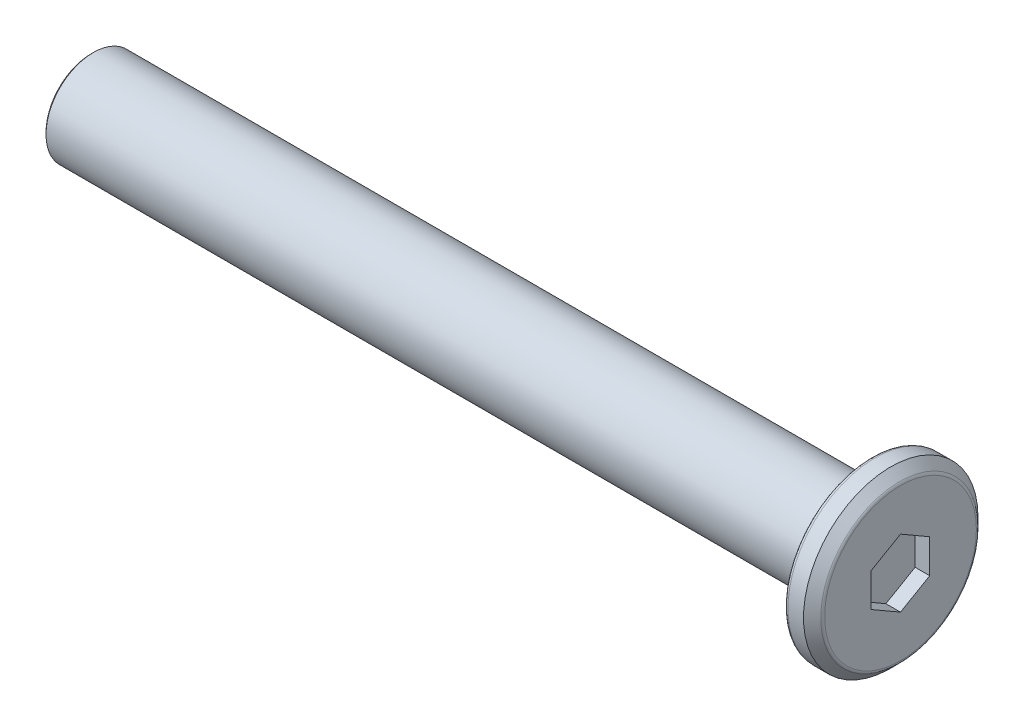
ISO-10303-21;
HEADER;
FILE_DESCRIPTION(('STEP AP214'),'2;1');
FILE_NAME('part.step','',(''),(''),'','','');
FILE_SCHEMA(('AUTOMOTIVE_DESIGN { 1 0 10303 214 1 1 1 1 }'));
ENDSEC;
DATA;
#1=APPLICATION_CONTEXT('core data for automotive mechanical design processes');
#2=APPLICATION_PROTOCOL_DEFINITION('international standard','automotive_design',2000,#1);
#3=PRODUCT_CONTEXT('',#1,'mechanical');
#4=PRODUCT('Part','Part','',(#3));
#5=PRODUCT_RELATED_PRODUCT_CATEGORY('part','',(#4));
#6=PRODUCT_DEFINITION_FORMATION('','',#4);
#7=PRODUCT_DEFINITION_CONTEXT('part definition',#1,'design');
#8=PRODUCT_DEFINITION('design','',#6,#7);
#9=PRODUCT_DEFINITION_SHAPE('','',#8);
#10=(LENGTH_UNIT() NAMED_UNIT(*) SI_UNIT(.MILLI.,.METRE.));
#11=(NAMED_UNIT(*) PLANE_ANGLE_UNIT() SI_UNIT($,.RADIAN.));
#12=(NAMED_UNIT(*) SI_UNIT($,.STERADIAN.) SOLID_ANGLE_UNIT());
#13=UNCERTAINTY_MEASURE_WITH_UNIT(LENGTH_MEASURE(1.E-05),#10,'distance_accuracy_value','');
#14=(GEOMETRIC_REPRESENTATION_CONTEXT(3) GLOBAL_UNCERTAINTY_ASSIGNED_CONTEXT((#13)) GLOBAL_UNIT_ASSIGNED_CONTEXT((#10,
#11,#12)) REPRESENTATION_CONTEXT('',''));
#15=CARTESIAN_POINT('',(0.,0.,0.));
#16=DIRECTION('',(0.,0.,1.));
#17=DIRECTION('',(1.,0.,0.));
#18=AXIS2_PLACEMENT_3D('',#15,#16,#17);
#19=CARTESIAN_POINT('',(0.75,0.,0.));
#20=DIRECTION('',(1.,0.,0.));
#21=DIRECTION('',(0.,0.,-1.));
#22=AXIS2_PLACEMENT_3D('',#19,#20,#21);
#23=PLANE('',#22);
#24=CARTESIAN_POINT('',(0.75,0.,0.));
#25=DIRECTION('',(1.,0.,0.));
#26=DIRECTION('',(0.,0.,-1.));
#27=AXIS2_PLACEMENT_3D('',#24,#25,#26);
#28=CIRCLE('',#27,3.89215728752537);
#29=CARTESIAN_POINT('',(0.75,0.,-3.89215728752537));
#30=VERTEX_POINT('',#29);
#31=EDGE_CURVE('E138',#30,#30,#28,.T.);
#32=ORIENTED_EDGE('',*,*,#31,.T.);
#33=EDGE_LOOP('',(#32));
#34=FACE_BOUND('',#33,.T.);
#35=DIRECTION('',(0.,-1.,0.));
#36=VECTOR('',#35,1.);
#37=CARTESIAN_POINT('',(0.75,0.,-1.5));
#38=LINE('',#37,#36);
#39=CARTESIAN_POINT('',(0.75,0.866025403784438,-1.5));
#40=VERTEX_POINT('',#39);
#41=CARTESIAN_POINT('',(0.75,-0.866025403784439,-1.5));
#42=VERTEX_POINT('',#41);
#43=EDGE_CURVE('E120',#40,#42,#38,.T.);
#44=ORIENTED_EDGE('',*,*,#43,.T.);
#45=DIRECTION('',(0.,-0.5,0.866025403784439));
#46=VECTOR('',#45,1.);
#47=CARTESIAN_POINT('',(0.75,-1.29903810567666,-0.75));
#48=LINE('',#47,#46);
#49=CARTESIAN_POINT('',(0.75,-1.73205080756888,0.));
#50=VERTEX_POINT('',#49);
#51=EDGE_CURVE('E40',#42,#50,#48,.T.);
#52=ORIENTED_EDGE('',*,*,#51,.T.);
#53=DIRECTION('',(0.,0.5,0.866025403784439));
#54=VECTOR('',#53,1.);
#55=CARTESIAN_POINT('',(0.75,-1.29903810567666,0.75));
#56=LINE('',#55,#54);
#57=CARTESIAN_POINT('',(0.75,-0.866025403784438,1.5));
#58=VERTEX_POINT('',#57);
#59=EDGE_CURVE('E76',#50,#58,#56,.T.);
#60=ORIENTED_EDGE('',*,*,#59,.T.);
#61=DIRECTION('',(0.,1.,0.));
#62=VECTOR('',#61,1.);
#63=CARTESIAN_POINT('',(0.75,0.,1.5));
#64=LINE('',#63,#62);
#65=CARTESIAN_POINT('',(0.75,0.866025403784439,1.5));
#66=VERTEX_POINT('',#65);
#67=EDGE_CURVE('E111',#58,#66,#64,.T.);
#68=ORIENTED_EDGE('',*,*,#67,.T.);
#69=DIRECTION('',(0.,0.5,-0.866025403784439));
#70=VECTOR('',#69,1.);
#71=CARTESIAN_POINT('',(0.75,1.29903810567666,0.75));
#72=LINE('',#71,#70);
#73=CARTESIAN_POINT('',(0.75,1.73205080756888,0.));
#74=VERTEX_POINT('',#73);
#75=EDGE_CURVE('E114',#66,#74,#72,.T.);
#76=ORIENTED_EDGE('',*,*,#75,.T.);
#77=DIRECTION('',(0.,-0.5,-0.866025403784439));
#78=VECTOR('',#77,1.);
#79=CARTESIAN_POINT('',(0.75,1.29903810567666,-0.75));
#80=LINE('',#79,#78);
#81=EDGE_CURVE('E117',#74,#40,#80,.T.);
#82=ORIENTED_EDGE('',*,*,#81,.T.);
#83=EDGE_LOOP('',(#44,#52,#60,#68,#76,#82));
#84=FACE_BOUND('',#83,.T.);
#85=ADVANCED_FACE('F16',(#34,#84),#23,.T.);
#86=CARTESIAN_POINT('',(-0.75,0.,0.));
#87=DIRECTION('',(1.,0.,0.));
#88=DIRECTION('',(0.,0.,-1.));
#89=AXIS2_PLACEMENT_3D('',#86,#87,#88);
#90=PLANE('',#89);
#91=CARTESIAN_POINT('',(-0.75,0.,0.));
#92=DIRECTION('',(1.,0.,0.));
#93=DIRECTION('',(0.,0.,-1.));
#94=AXIS2_PLACEMENT_3D('',#91,#92,#93);
#95=CIRCLE('',#94,4.275);
#96=CARTESIAN_POINT('',(-0.75,0.,-4.275));
#97=VERTEX_POINT('',#96);
#98=EDGE_CURVE('E135',#97,#97,#95,.F.);
#99=ORIENTED_EDGE('',*,*,#98,.T.);
#100=EDGE_LOOP('',(#99));
#101=FACE_BOUND('',#100,.T.);
#102=CARTESIAN_POINT('',(-0.75,0.,0.));
#103=DIRECTION('',(1.,0.,0.));
#104=DIRECTION('',(0.,0.,-1.));
#105=AXIS2_PLACEMENT_3D('',#102,#103,#104);
#106=CIRCLE('',#105,2.675);
#107=CARTESIAN_POINT('',(-0.75,0.,-2.675));
#108=VERTEX_POINT('',#107);
#109=EDGE_CURVE('E129',#108,#108,#106,.T.);
#110=ORIENTED_EDGE('',*,*,#109,.T.);
#111=EDGE_LOOP('',(#110));
#112=FACE_BOUND('',#111,.T.);
#113=ADVANCED_FACE('F159',(#101,#112),#90,.F.);
#114=CARTESIAN_POINT('',(0.75,0.,0.));
#115=DIRECTION('',(-1.,0.,0.));
#116=DIRECTION('',(0.,0.,1.));
#117=AXIS2_PLACEMENT_3D('',#114,#115,#116);
#118=CYLINDRICAL_SURFACE('',#117,4.475);
#119=CARTESIAN_POINT('',(-0.55,0.,0.));
#120=DIRECTION('',(1.,0.,0.));
#121=DIRECTION('',(0.,0.,-1.));
#122=AXIS2_PLACEMENT_3D('',#119,#120,#121);
#123=CIRCLE('',#122,4.475);
#124=CARTESIAN_POINT('',(-0.55,0.,-4.475));
#125=VERTEX_POINT('',#124);
#126=EDGE_CURVE('E132',#125,#125,#123,.T.);
#127=ORIENTED_EDGE('',*,*,#126,.T.);
#128=EDGE_LOOP('',(#127));
#129=FACE_BOUND('',#128,.T.);
#130=CARTESIAN_POINT('',(0.249999999999994,0.,0.));
#131=DIRECTION('',(1.,0.,0.));
#132=DIRECTION('',(0.,0.,-1.));
#133=AXIS2_PLACEMENT_3D('',#130,#131,#132);
#134=CIRCLE('',#133,4.475);
#135=CARTESIAN_POINT('',(0.249999999999994,0.,-4.475));
#136=VERTEX_POINT('',#135);
#137=EDGE_CURVE('E123',#136,#136,#134,.F.);
#138=ORIENTED_EDGE('',*,*,#137,.T.);
#139=EDGE_LOOP('',(#138));
#140=FACE_BOUND('',#139,.T.);
#141=ADVANCED_FACE('F165',(#129,#140),#118,.T.);
#142=CARTESIAN_POINT('',(-40.75,0.,0.));
#143=DIRECTION('',(1.,0.,0.));
#144=DIRECTION('',(0.,0.,-1.));
#145=AXIS2_PLACEMENT_3D('',#142,#143,#144);
#146=CYLINDRICAL_SURFACE('',#145,2.425);
#147=CARTESIAN_POINT('',(-40.65,0.,0.));
#148=DIRECTION('',(-1.,0.,0.));
#149=DIRECTION('',(0.,0.,1.));
#150=AXIS2_PLACEMENT_3D('',#147,#148,#149);
#151=CIRCLE('',#150,2.425);
#152=CARTESIAN_POINT('',(-40.65,0.,2.425));
#153=VERTEX_POINT('',#152);
#154=EDGE_CURVE('E10',#153,#153,#151,.F.);
#155=ORIENTED_EDGE('',*,*,#154,.T.);
#156=EDGE_LOOP('',(#155));
#157=FACE_BOUND('',#156,.T.);
#158=CARTESIAN_POINT('',(-1.,0.,0.));
#159=DIRECTION('',(1.,0.,0.));
#160=DIRECTION('',(0.,0.,-1.));
#161=AXIS2_PLACEMENT_3D('',#158,#159,#160);
#162=CIRCLE('',#161,2.425);
#163=CARTESIAN_POINT('',(-1.,0.,-2.425));
#164=VERTEX_POINT('',#163);
#165=EDGE_CURVE('E126',#164,#164,#162,.F.);
#166=ORIENTED_EDGE('',*,*,#165,.T.);
#167=EDGE_LOOP('',(#166));
#168=FACE_BOUND('',#167,.T.);
#169=ADVANCED_FACE('F170',(#157,#168),#146,.T.);
#170=CARTESIAN_POINT('',(-40.75,0.,0.));
#171=DIRECTION('',(-1.,0.,0.));
#172=DIRECTION('',(0.,0.,1.));
#173=AXIS2_PLACEMENT_3D('',#170,#171,#172);
#174=PLANE('',#173);
#175=CARTESIAN_POINT('',(-40.75,0.,0.));
#176=DIRECTION('',(-1.,0.,0.));
#177=DIRECTION('',(0.,0.,1.));
#178=AXIS2_PLACEMENT_3D('',#175,#176,#177);
#179=CIRCLE('',#178,2.325);
#180=CARTESIAN_POINT('',(-40.75,0.,2.325));
#181=VERTEX_POINT('',#180);
#182=EDGE_CURVE('E25',#181,#181,#179,.T.);
#183=ORIENTED_EDGE('',*,*,#182,.T.);
#184=EDGE_LOOP('',(#183));
#185=FACE_BOUND('',#184,.T.);
#186=ADVANCED_FACE('F146',(#185),#174,.T.);
#187=CARTESIAN_POINT('',(2.,-1.73205080756888,0.));
#188=DIRECTION('',(0.,0.866025403784439,0.5));
#189=DIRECTION('',(0.,-0.5,0.866025403784439));
#190=AXIS2_PLACEMENT_3D('',#187,#188,#189);
#191=PLANE('',#190);
#192=DIRECTION('',(-1.,0.,0.));
#193=VECTOR('',#192,1.);
#194=CARTESIAN_POINT('',(2.,-0.866025403784439,-1.5));
#195=LINE('',#194,#193);
#196=CARTESIAN_POINT('',(0.,-0.866025403784439,-1.5));
#197=VERTEX_POINT('',#196);
#198=EDGE_CURVE('E69',#42,#197,#195,.T.);
#199=ORIENTED_EDGE('',*,*,#198,.T.);
#200=DIRECTION('',(0.,0.5,-0.866025403784439));
#201=VECTOR('',#200,1.);
#202=CARTESIAN_POINT('',(0.,-1.73205080756888,0.));
#203=LINE('',#202,#201);
#204=CARTESIAN_POINT('',(0.,-1.73205080756888,0.));
#205=VERTEX_POINT('',#204);
#206=EDGE_CURVE('E73',#205,#197,#203,.T.);
#207=ORIENTED_EDGE('',*,*,#206,.F.);
#208=DIRECTION('',(-1.,0.,0.));
#209=VECTOR('',#208,1.);
#210=CARTESIAN_POINT('',(2.,-1.73205080756888,0.));
#211=LINE('',#210,#209);
#212=EDGE_CURVE('E101',#50,#205,#211,.T.);
#213=ORIENTED_EDGE('',*,*,#212,.F.);
#214=ORIENTED_EDGE('',*,*,#51,.F.);
#215=EDGE_LOOP('',(#199,#207,#213,#214));
#216=FACE_BOUND('',#215,.T.);
#217=ADVANCED_FACE('F71',(#216),#191,.T.);
#218=CARTESIAN_POINT('',(2.,-0.866025403784439,-1.5));
#219=DIRECTION('',(0.,0.,1.));
#220=DIRECTION('',(1.,0.,0.));
#221=AXIS2_PLACEMENT_3D('',#218,#219,#220);
#222=PLANE('',#221);
#223=DIRECTION('',(-1.,0.,0.));
#224=VECTOR('',#223,1.);
#225=CARTESIAN_POINT('',(2.,0.866025403784438,-1.5));
#226=LINE('',#225,#224);
#227=CARTESIAN_POINT('',(0.,0.866025403784438,-1.5));
#228=VERTEX_POINT('',#227);
#229=EDGE_CURVE('E77',#40,#228,#226,.T.);
#230=ORIENTED_EDGE('',*,*,#229,.T.);
#231=DIRECTION('',(0.,1.,0.));
#232=VECTOR('',#231,1.);
#233=CARTESIAN_POINT('',(0.,-0.866025403784439,-1.5));
#234=LINE('',#233,#232);
#235=EDGE_CURVE('E80',#197,#228,#234,.T.);
#236=ORIENTED_EDGE('',*,*,#235,.F.);
#237=ORIENTED_EDGE('',*,*,#198,.F.);
#238=ORIENTED_EDGE('',*,*,#43,.F.);
#239=EDGE_LOOP('',(#230,#236,#237,#238));
#240=FACE_BOUND('',#239,.T.);
#241=ADVANCED_FACE('F81',(#240),#222,.T.);
#242=CARTESIAN_POINT('',(2.,0.866025403784438,-1.5));
#243=DIRECTION('',(0.,-0.866025403784439,0.5));
#244=DIRECTION('',(0.,-0.5,-0.866025403784439));
#245=AXIS2_PLACEMENT_3D('',#242,#243,#244);
#246=PLANE('',#245);
#247=DIRECTION('',(-1.,0.,0.));
#248=VECTOR('',#247,1.);
#249=CARTESIAN_POINT('',(2.,1.73205080756888,0.));
#250=LINE('',#249,#248);
#251=CARTESIAN_POINT('',(0.,1.73205080756888,0.));
#252=VERTEX_POINT('',#251);
#253=EDGE_CURVE('E106',#74,#252,#250,.T.);
#254=ORIENTED_EDGE('',*,*,#253,.T.);
#255=DIRECTION('',(0.,0.5,0.866025403784438));
#256=VECTOR('',#255,1.);
#257=CARTESIAN_POINT('',(0.,0.866025403784438,-1.5));
#258=LINE('',#257,#256);
#259=EDGE_CURVE('E86',#228,#252,#258,.T.);
#260=ORIENTED_EDGE('',*,*,#259,.F.);
#261=ORIENTED_EDGE('',*,*,#229,.F.);
#262=ORIENTED_EDGE('',*,*,#81,.F.);
#263=EDGE_LOOP('',(#254,#260,#261,#262));
#264=FACE_BOUND('',#263,.T.);
#265=ADVANCED_FACE('F211',(#264),#246,.T.);
#266=CARTESIAN_POINT('',(2.,1.73205080756888,0.));
#267=DIRECTION('',(0.,-0.866025403784439,-0.5));
#268=DIRECTION('',(0.,0.5,-0.866025403784439));
#269=AXIS2_PLACEMENT_3D('',#266,#267,#268);
#270=PLANE('',#269);
#271=DIRECTION('',(-1.,0.,0.));
#272=VECTOR('',#271,1.);
#273=CARTESIAN_POINT('',(2.,0.866025403784439,1.5));
#274=LINE('',#273,#272);
#275=CARTESIAN_POINT('',(0.,0.866025403784439,1.5));
#276=VERTEX_POINT('',#275);
#277=EDGE_CURVE('E104',#66,#276,#274,.T.);
#278=ORIENTED_EDGE('',*,*,#277,.T.);
#279=DIRECTION('',(0.,-0.5,0.866025403784439));
#280=VECTOR('',#279,1.);
#281=CARTESIAN_POINT('',(0.,1.73205080756888,0.));
#282=LINE('',#281,#280);
#283=EDGE_CURVE('E95',#252,#276,#282,.T.);
#284=ORIENTED_EDGE('',*,*,#283,.F.);
#285=ORIENTED_EDGE('',*,*,#253,.F.);
#286=ORIENTED_EDGE('',*,*,#75,.F.);
#287=EDGE_LOOP('',(#278,#284,#285,#286));
#288=FACE_BOUND('',#287,.T.);
#289=ADVANCED_FACE('F214',(#288),#270,.T.);
#290=CARTESIAN_POINT('',(2.,0.866025403784439,1.5));
#291=DIRECTION('',(0.,0.,-1.));
#292=DIRECTION('',(-1.,0.,0.));
#293=AXIS2_PLACEMENT_3D('',#290,#291,#292);
#294=PLANE('',#293);
#295=DIRECTION('',(-1.,0.,0.));
#296=VECTOR('',#295,1.);
#297=CARTESIAN_POINT('',(2.,-0.866025403784438,1.5));
#298=LINE('',#297,#296);
#299=CARTESIAN_POINT('',(0.,-0.866025403784438,1.5));
#300=VERTEX_POINT('',#299);
#301=EDGE_CURVE('E32',#58,#300,#298,.T.);
#302=ORIENTED_EDGE('',*,*,#301,.T.);
#303=DIRECTION('',(0.,-1.,0.));
#304=VECTOR('',#303,1.);
#305=CARTESIAN_POINT('',(0.,0.866025403784439,1.5));
#306=LINE('',#305,#304);
#307=EDGE_CURVE('E98',#276,#300,#306,.T.);
#308=ORIENTED_EDGE('',*,*,#307,.F.);
#309=ORIENTED_EDGE('',*,*,#277,.F.);
#310=ORIENTED_EDGE('',*,*,#67,.F.);
#311=EDGE_LOOP('',(#302,#308,#309,#310));
#312=FACE_BOUND('',#311,.T.);
#313=ADVANCED_FACE('F218',(#312),#294,.T.);
#314=CARTESIAN_POINT('',(2.,-0.866025403784438,1.5));
#315=DIRECTION('',(0.,0.866025403784438,-0.5));
#316=DIRECTION('',(0.,0.5,0.866025403784439));
#317=AXIS2_PLACEMENT_3D('',#314,#315,#316);
#318=PLANE('',#317);
#319=ORIENTED_EDGE('',*,*,#212,.T.);
#320=DIRECTION('',(0.,-0.5,-0.866025403784438));
#321=VECTOR('',#320,1.);
#322=CARTESIAN_POINT('',(0.,-0.866025403784438,1.5));
#323=LINE('',#322,#321);
#324=EDGE_CURVE('E91',#300,#205,#323,.T.);
#325=ORIENTED_EDGE('',*,*,#324,.F.);
#326=ORIENTED_EDGE('',*,*,#301,.F.);
#327=ORIENTED_EDGE('',*,*,#59,.F.);
#328=EDGE_LOOP('',(#319,#325,#326,#327));
#329=FACE_BOUND('',#328,.T.);
#330=ADVANCED_FACE('F222',(#329),#318,.T.);
#331=CARTESIAN_POINT('',(0.,0.,0.));
#332=DIRECTION('',(1.,0.,0.));
#333=DIRECTION('',(0.,0.,-1.));
#334=AXIS2_PLACEMENT_3D('',#331,#332,#333);
#335=PLANE('',#334);
#336=ORIENTED_EDGE('',*,*,#206,.T.);
#337=ORIENTED_EDGE('',*,*,#235,.T.);
#338=ORIENTED_EDGE('',*,*,#259,.T.);
#339=ORIENTED_EDGE('',*,*,#283,.T.);
#340=ORIENTED_EDGE('',*,*,#307,.T.);
#341=ORIENTED_EDGE('',*,*,#324,.T.);
#342=EDGE_LOOP('',(#336,#337,#338,#339,#340,#341));
#343=FACE_BOUND('',#342,.T.);
#344=ADVANCED_FACE('F89',(#343),#335,.T.);
#345=CARTESIAN_POINT('',(0.75,0.,0.));
#346=DIRECTION('',(-1.,0.,0.));
#347=DIRECTION('',(0.,0.,1.));
#348=AXIS2_PLACEMENT_3D('',#345,#346,#347);
#349=CONICAL_SURFACE('',#348,3.97499999999999,0.785398163397449);
#350=CARTESIAN_POINT('',(0.69142135623731,0.,0.));
#351=DIRECTION('',(1.,0.,0.));
#352=DIRECTION('',(0.,0.,-1.));
#353=AXIS2_PLACEMENT_3D('',#350,#351,#352);
#354=CIRCLE('',#353,4.03357864376268);
#355=CARTESIAN_POINT('',(0.69142135623731,0.,-4.03357864376268));
#356=VERTEX_POINT('',#355);
#357=EDGE_CURVE('E141',#356,#356,#354,.F.);
#358=ORIENTED_EDGE('',*,*,#357,.T.);
#359=EDGE_LOOP('',(#358));
#360=FACE_BOUND('',#359,.T.);
#361=ORIENTED_EDGE('',*,*,#137,.F.);
#362=EDGE_LOOP('',(#361));
#363=FACE_BOUND('',#362,.T.);
#364=ADVANCED_FACE('F176',(#360,#363),#349,.T.);
#365=CARTESIAN_POINT('',(-1.,0.,0.));
#366=DIRECTION('',(1.,0.,0.));
#367=DIRECTION('',(0.,0.,-1.));
#368=AXIS2_PLACEMENT_3D('',#365,#366,#367);
#369=TOROIDAL_SURFACE('',#368,2.675,0.25);
#370=ORIENTED_EDGE('',*,*,#109,.F.);
#371=EDGE_LOOP('',(#370));
#372=FACE_BOUND('',#371,.T.);
#373=ORIENTED_EDGE('',*,*,#165,.F.);
#374=EDGE_LOOP('',(#373));
#375=FACE_BOUND('',#374,.T.);
#376=ADVANCED_FACE('F179',(#372,#375),#369,.F.);
#377=CARTESIAN_POINT('',(-0.55,0.,0.));
#378=DIRECTION('',(1.,0.,0.));
#379=DIRECTION('',(0.,0.,-1.));
#380=AXIS2_PLACEMENT_3D('',#377,#378,#379);
#381=TOROIDAL_SURFACE('',#380,4.275,0.2);
#382=ORIENTED_EDGE('',*,*,#98,.F.);
#383=EDGE_LOOP('',(#382));
#384=FACE_BOUND('',#383,.T.);
#385=ORIENTED_EDGE('',*,*,#126,.F.);
#386=EDGE_LOOP('',(#385));
#387=FACE_BOUND('',#386,.T.);
#388=ADVANCED_FACE('F155',(#384,#387),#381,.T.);
#389=CARTESIAN_POINT('',(0.55,0.,0.));
#390=DIRECTION('',(1.,0.,0.));
#391=DIRECTION('',(0.,0.,-1.));
#392=AXIS2_PLACEMENT_3D('',#389,#390,#391);
#393=TOROIDAL_SURFACE('',#392,3.89215728752537,0.2);
#394=ORIENTED_EDGE('',*,*,#357,.F.);
#395=EDGE_LOOP('',(#394));
#396=FACE_BOUND('',#395,.T.);
#397=ORIENTED_EDGE('',*,*,#31,.F.);
#398=EDGE_LOOP('',(#397));
#399=FACE_BOUND('',#398,.T.);
#400=ADVANCED_FACE('F149',(#396,#399),#393,.T.);
#401=CARTESIAN_POINT('',(-40.75,0.,0.));
#402=DIRECTION('',(1.,0.,0.));
#403=DIRECTION('',(0.,0.,-1.));
#404=AXIS2_PLACEMENT_3D('',#401,#402,#403);
#405=CONICAL_SURFACE('',#404,2.325,0.785398163397483);
#406=ORIENTED_EDGE('',*,*,#154,.F.);
#407=EDGE_LOOP('',(#406));
#408=FACE_BOUND('',#407,.T.);
#409=ORIENTED_EDGE('',*,*,#182,.F.);
#410=EDGE_LOOP('',(#409));
#411=FACE_BOUND('',#410,.T.);
#412=ADVANCED_FACE('F19',(#408,#411),#405,.T.);
#413=CLOSED_SHELL('',(#85,#113,#141,#169,#186,#217,#241,#265,#289,#313,#330,#344,#364,#376,#388,
#400,#412));
#414=MANIFOLD_SOLID_BREP('B1',#413);
#415=ADVANCED_BREP_SHAPE_REPRESENTATION('',(#18,#414),#14);
#416=SHAPE_DEFINITION_REPRESENTATION(#9,#415);
ENDSEC;
END-ISO-10303-21;
